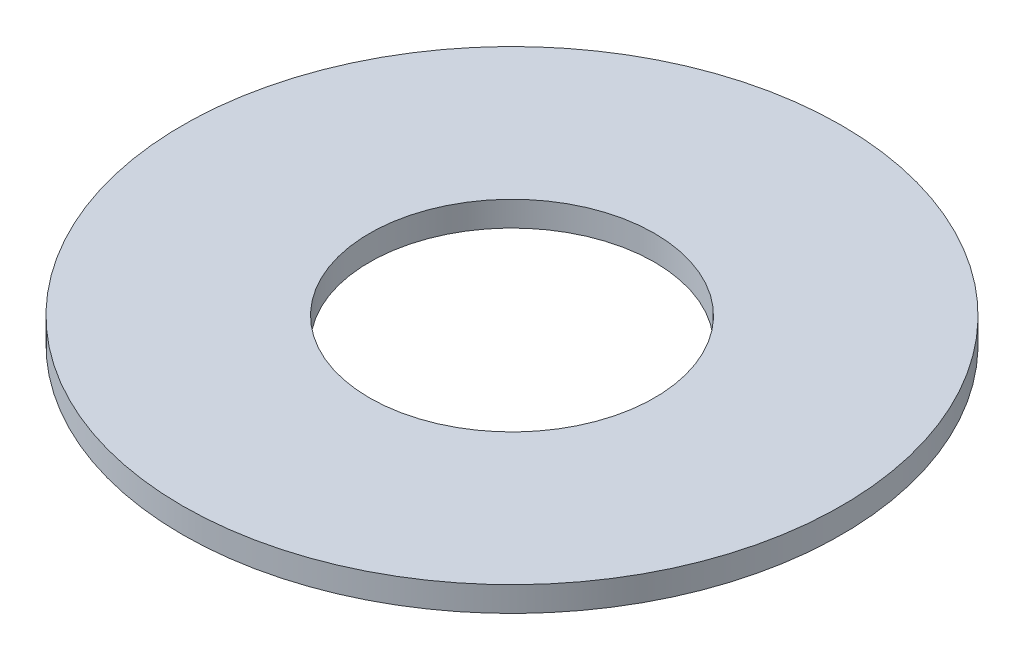
ISO-10303-21;
HEADER;
FILE_DESCRIPTION(('STEP AP214'),'2;1');
FILE_NAME('part.step','',(''),(''),'','','');
FILE_SCHEMA(('AUTOMOTIVE_DESIGN { 1 0 10303 214 1 1 1 1 }'));
ENDSEC;
DATA;
#1=APPLICATION_CONTEXT('core data for automotive mechanical design processes');
#2=APPLICATION_PROTOCOL_DEFINITION('international standard','automotive_design',2000,#1);
#3=PRODUCT_CONTEXT('',#1,'mechanical');
#4=PRODUCT('Part','Part','',(#3));
#5=PRODUCT_RELATED_PRODUCT_CATEGORY('part','',(#4));
#6=PRODUCT_DEFINITION_FORMATION('','',#4);
#7=PRODUCT_DEFINITION_CONTEXT('part definition',#1,'design');
#8=PRODUCT_DEFINITION('design','',#6,#7);
#9=PRODUCT_DEFINITION_SHAPE('','',#8);
#10=(LENGTH_UNIT() NAMED_UNIT(*) SI_UNIT(.MILLI.,.METRE.));
#11=(NAMED_UNIT(*) PLANE_ANGLE_UNIT() SI_UNIT($,.RADIAN.));
#12=(NAMED_UNIT(*) SI_UNIT($,.STERADIAN.) SOLID_ANGLE_UNIT());
#13=UNCERTAINTY_MEASURE_WITH_UNIT(LENGTH_MEASURE(1.E-05),#10,'distance_accuracy_value','');
#14=(GEOMETRIC_REPRESENTATION_CONTEXT(3) GLOBAL_UNCERTAINTY_ASSIGNED_CONTEXT((#13)) GLOBAL_UNIT_ASSIGNED_CONTEXT((#10,
#11,#12)) REPRESENTATION_CONTEXT('',''));
#15=CARTESIAN_POINT('',(0.,0.,0.));
#16=DIRECTION('',(0.,0.,1.));
#17=DIRECTION('',(1.,0.,0.));
#18=AXIS2_PLACEMENT_3D('',#15,#16,#17);
#19=CARTESIAN_POINT('',(0.,7.,0.));
#20=DIRECTION('',(0.,-1.,0.));
#21=DIRECTION('',(0.,0.,-1.));
#22=AXIS2_PLACEMENT_3D('',#19,#20,#21);
#23=CYLINDRICAL_SURFACE('',#22,92.5);
#24=CARTESIAN_POINT('',(0.,7.,0.));
#25=DIRECTION('',(0.,1.,0.));
#26=DIRECTION('',(0.,0.,1.));
#27=AXIS2_PLACEMENT_3D('',#24,#25,#26);
#28=CIRCLE('',#27,92.5);
#29=CARTESIAN_POINT('',(0.,7.,92.5));
#30=VERTEX_POINT('',#29);
#31=EDGE_CURVE('E10',#30,#30,#28,.T.);
#32=ORIENTED_EDGE('',*,*,#31,.F.);
#33=EDGE_LOOP('',(#32));
#34=FACE_BOUND('',#33,.T.);
#35=CARTESIAN_POINT('',(0.,0.,0.));
#36=DIRECTION('',(0.,1.,0.));
#37=DIRECTION('',(0.,0.,1.));
#38=AXIS2_PLACEMENT_3D('',#35,#36,#37);
#39=CIRCLE('',#38,92.5);
#40=CARTESIAN_POINT('',(0.,0.,92.5));
#41=VERTEX_POINT('',#40);
#42=EDGE_CURVE('E37',#41,#41,#39,.T.);
#43=ORIENTED_EDGE('',*,*,#42,.T.);
#44=EDGE_LOOP('',(#43));
#45=FACE_BOUND('',#44,.T.);
#46=ADVANCED_FACE('F40',(#34,#45),#23,.T.);
#47=CARTESIAN_POINT('',(0.,7.,0.));
#48=DIRECTION('',(0.,1.,0.));
#49=DIRECTION('',(0.,0.,1.));
#50=AXIS2_PLACEMENT_3D('',#47,#48,#49);
#51=PLANE('',#50);
#52=CARTESIAN_POINT('',(0.,7.,0.));
#53=DIRECTION('',(0.,1.,0.));
#54=DIRECTION('',(0.,0.,1.));
#55=AXIS2_PLACEMENT_3D('',#52,#53,#54);
#56=CIRCLE('',#55,40.);
#57=CARTESIAN_POINT('',(0.,7.,40.));
#58=VERTEX_POINT('',#57);
#59=EDGE_CURVE('E50',#58,#58,#56,.T.);
#60=ORIENTED_EDGE('',*,*,#59,.F.);
#61=EDGE_LOOP('',(#60));
#62=FACE_BOUND('',#61,.T.);
#63=ORIENTED_EDGE('',*,*,#31,.T.);
#64=EDGE_LOOP('',(#63));
#65=FACE_BOUND('',#64,.T.);
#66=ADVANCED_FACE('F59',(#62,#65),#51,.T.);
#67=CARTESIAN_POINT('',(0.,0.,0.));
#68=DIRECTION('',(0.,1.,0.));
#69=DIRECTION('',(0.,0.,1.));
#70=AXIS2_PLACEMENT_3D('',#67,#68,#69);
#71=PLANE('',#70);
#72=CARTESIAN_POINT('',(0.,0.,0.));
#73=DIRECTION('',(0.,1.,0.));
#74=DIRECTION('',(0.,0.,1.));
#75=AXIS2_PLACEMENT_3D('',#72,#73,#74);
#76=CIRCLE('',#75,40.);
#77=CARTESIAN_POINT('',(0.,0.,40.));
#78=VERTEX_POINT('',#77);
#79=EDGE_CURVE('E47',#78,#78,#76,.T.);
#80=ORIENTED_EDGE('',*,*,#79,.T.);
#81=EDGE_LOOP('',(#80));
#82=FACE_BOUND('',#81,.T.);
#83=ORIENTED_EDGE('',*,*,#42,.F.);
#84=EDGE_LOOP('',(#83));
#85=FACE_BOUND('',#84,.T.);
#86=ADVANCED_FACE('F58',(#82,#85),#71,.F.);
#87=CARTESIAN_POINT('',(0.,7.,0.));
#88=DIRECTION('',(0.,-1.,0.));
#89=DIRECTION('',(0.,0.,-1.));
#90=AXIS2_PLACEMENT_3D('',#87,#88,#89);
#91=CYLINDRICAL_SURFACE('',#90,40.);
#92=ORIENTED_EDGE('',*,*,#59,.T.);
#93=EDGE_LOOP('',(#92));
#94=FACE_BOUND('',#93,.T.);
#95=ORIENTED_EDGE('',*,*,#79,.F.);
#96=EDGE_LOOP('',(#95));
#97=FACE_BOUND('',#96,.T.);
#98=ADVANCED_FACE('F54',(#94,#97),#91,.F.);
#99=CLOSED_SHELL('',(#46,#66,#86,#98));
#100=MANIFOLD_SOLID_BREP('B2',#99);
#101=ADVANCED_BREP_SHAPE_REPRESENTATION('',(#18,#100),#14);
#102=SHAPE_DEFINITION_REPRESENTATION(#9,#101);
ENDSEC;
END-ISO-10303-21;
